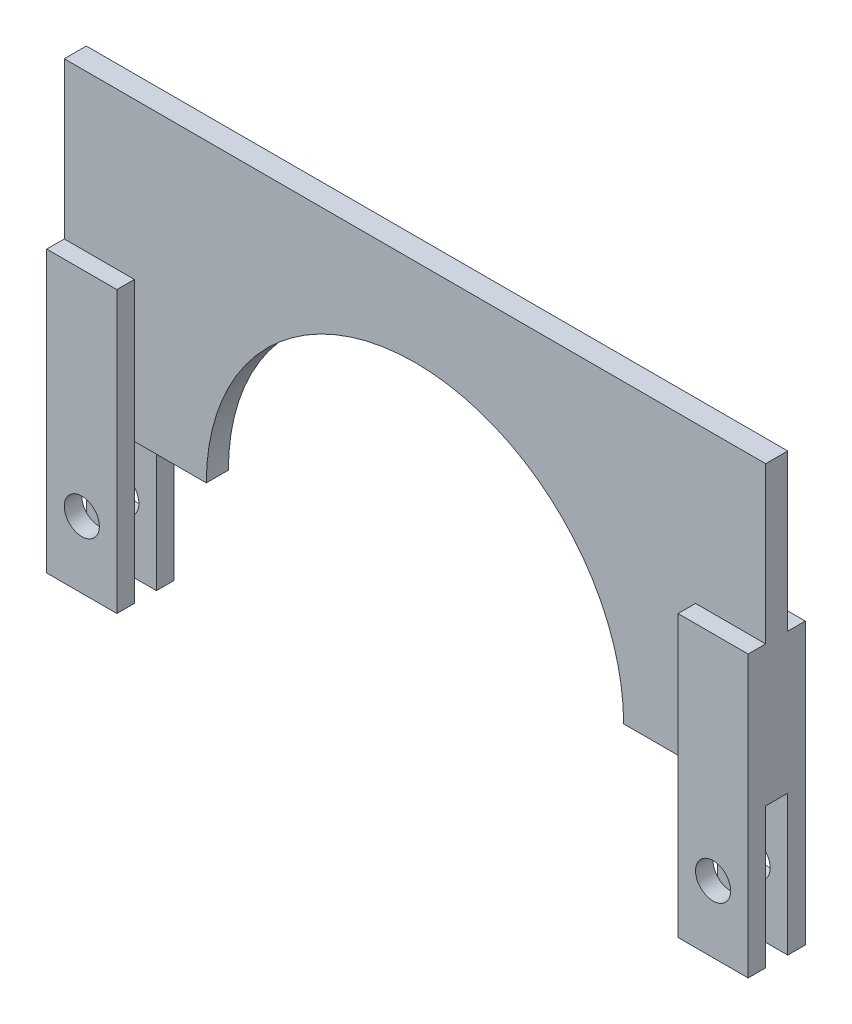
ISO-10303-21;
HEADER;
FILE_DESCRIPTION(('STEP AP214'),'2;1');
FILE_NAME('part.step','',(''),(''),'','','');
FILE_SCHEMA(('AUTOMOTIVE_DESIGN { 1 0 10303 214 1 1 1 1 }'));
ENDSEC;
DATA;
#1=APPLICATION_CONTEXT('core data for automotive mechanical design processes');
#2=APPLICATION_PROTOCOL_DEFINITION('international standard','automotive_design',2000,#1);
#3=PRODUCT_CONTEXT('',#1,'mechanical');
#4=PRODUCT('Part','Part','',(#3));
#5=PRODUCT_RELATED_PRODUCT_CATEGORY('part','',(#4));
#6=PRODUCT_DEFINITION_FORMATION('','',#4);
#7=PRODUCT_DEFINITION_CONTEXT('part definition',#1,'design');
#8=PRODUCT_DEFINITION('design','',#6,#7);
#9=PRODUCT_DEFINITION_SHAPE('','',#8);
#10=(LENGTH_UNIT() NAMED_UNIT(*) SI_UNIT(.MILLI.,.METRE.));
#11=(NAMED_UNIT(*) PLANE_ANGLE_UNIT() SI_UNIT($,.RADIAN.));
#12=(NAMED_UNIT(*) SI_UNIT($,.STERADIAN.) SOLID_ANGLE_UNIT());
#13=UNCERTAINTY_MEASURE_WITH_UNIT(LENGTH_MEASURE(1.E-05),#10,'distance_accuracy_value','');
#14=(GEOMETRIC_REPRESENTATION_CONTEXT(3) GLOBAL_UNCERTAINTY_ASSIGNED_CONTEXT((#13)) GLOBAL_UNIT_ASSIGNED_CONTEXT((#10,
#11,#12)) REPRESENTATION_CONTEXT('',''));
#15=CARTESIAN_POINT('',(0.,0.,0.));
#16=DIRECTION('',(0.,0.,1.));
#17=DIRECTION('',(1.,0.,0.));
#18=AXIS2_PLACEMENT_3D('',#15,#16,#17);
#19=CARTESIAN_POINT('',(0.,0.,0.798558565));
#20=DIRECTION('',(0.,0.,1.));
#21=DIRECTION('',(1.,0.,0.));
#22=AXIS2_PLACEMENT_3D('',#19,#20,#21);
#23=PLANE('',#22);
#24=DIRECTION('',(0.,-1.,0.));
#25=VECTOR('',#24,1.);
#26=CARTESIAN_POINT('',(-25.4,0.,0.798558565));
#27=LINE('',#26,#25);
#28=CARTESIAN_POINT('',(-25.4,21.463,0.798558565));
#29=VERTEX_POINT('',#28);
#30=CARTESIAN_POINT('',(-25.4,10.16,0.798558565));
#31=VERTEX_POINT('',#30);
#32=EDGE_CURVE('E65',#29,#31,#27,.T.);
#33=ORIENTED_EDGE('',*,*,#32,.T.);
#34=DIRECTION('',(-1.,0.,0.));
#35=VECTOR('',#34,1.);
#36=CARTESIAN_POINT('',(0.,10.16,0.798558565));
#37=LINE('',#36,#35);
#38=CARTESIAN_POINT('',(-20.32,10.16,0.798558565));
#39=VERTEX_POINT('',#38);
#40=EDGE_CURVE('E60',#39,#31,#37,.T.);
#41=ORIENTED_EDGE('',*,*,#40,.F.);
#42=DIRECTION('',(0.,1.,0.));
#43=VECTOR('',#42,1.);
#44=CARTESIAN_POINT('',(-20.32,0.,0.798558565));
#45=LINE('',#44,#43);
#46=CARTESIAN_POINT('',(-20.32,0.,0.798558565));
#47=VERTEX_POINT('',#46);
#48=EDGE_CURVE('E250',#47,#39,#45,.T.);
#49=ORIENTED_EDGE('',*,*,#48,.F.);
#50=DIRECTION('',(1.,0.,0.));
#51=VECTOR('',#50,1.);
#52=CARTESIAN_POINT('',(-25.4,0.,0.798558565));
#53=LINE('',#52,#51);
#54=CARTESIAN_POINT('',(-15.113,0.,0.798558565));
#55=VERTEX_POINT('',#54);
#56=EDGE_CURVE('E408',#47,#55,#53,.T.);
#57=ORIENTED_EDGE('',*,*,#56,.T.);
#58=CARTESIAN_POINT('',(0.,0.,0.798558565));
#59=DIRECTION('',(0.,0.,-1.));
#60=DIRECTION('',(1.,0.,0.));
#61=AXIS2_PLACEMENT_3D('',#58,#59,#60);
#62=CIRCLE('',#61,15.113);
#63=CARTESIAN_POINT('',(15.113,0.,0.798558565));
#64=VERTEX_POINT('',#63);
#65=EDGE_CURVE('E390',#55,#64,#62,.T.);
#66=ORIENTED_EDGE('',*,*,#65,.T.);
#67=DIRECTION('',(1.,0.,0.));
#68=VECTOR('',#67,1.);
#69=CARTESIAN_POINT('',(15.113,0.,0.798558565));
#70=LINE('',#69,#68);
#71=CARTESIAN_POINT('',(20.32,0.,0.798558565));
#72=VERTEX_POINT('',#71);
#73=EDGE_CURVE('E396',#64,#72,#70,.T.);
#74=ORIENTED_EDGE('',*,*,#73,.T.);
#75=DIRECTION('',(0.,1.,0.));
#76=VECTOR('',#75,1.);
#77=CARTESIAN_POINT('',(20.32,0.,0.798558565));
#78=LINE('',#77,#76);
#79=CARTESIAN_POINT('',(20.32,10.16,0.798558565));
#80=VERTEX_POINT('',#79);
#81=EDGE_CURVE('E51',#72,#80,#78,.T.);
#82=ORIENTED_EDGE('',*,*,#81,.T.);
#83=DIRECTION('',(1.,0.,0.));
#84=VECTOR('',#83,1.);
#85=CARTESIAN_POINT('',(0.,10.16,0.798558565));
#86=LINE('',#85,#84);
#87=CARTESIAN_POINT('',(25.4,10.16,0.798558565));
#88=VERTEX_POINT('',#87);
#89=EDGE_CURVE('E345',#80,#88,#86,.T.);
#90=ORIENTED_EDGE('',*,*,#89,.T.);
#91=DIRECTION('',(0.,1.,0.));
#92=VECTOR('',#91,1.);
#93=CARTESIAN_POINT('',(25.4,21.463,0.798558565));
#94=LINE('',#93,#92);
#95=CARTESIAN_POINT('',(25.4,21.463,0.798558565));
#96=VERTEX_POINT('',#95);
#97=EDGE_CURVE('E400',#88,#96,#94,.T.);
#98=ORIENTED_EDGE('',*,*,#97,.T.);
#99=DIRECTION('',(-1.,0.,0.));
#100=VECTOR('',#99,1.);
#101=CARTESIAN_POINT('',(-25.4,21.463,0.798558565));
#102=LINE('',#101,#100);
#103=EDGE_CURVE('E403',#96,#29,#102,.T.);
#104=ORIENTED_EDGE('',*,*,#103,.T.);
#105=EDGE_LOOP('',(#33,#41,#49,#57,#66,#74,#82,#90,#98,#104));
#106=FACE_BOUND('',#105,.T.);
#107=ADVANCED_FACE('F41',(#106),#23,.T.);
#108=CARTESIAN_POINT('',(0.,0.,-0.798558565));
#109=DIRECTION('',(0.,0.,1.));
#110=DIRECTION('',(1.,0.,0.));
#111=AXIS2_PLACEMENT_3D('',#108,#109,#110);
#112=PLANE('',#111);
#113=DIRECTION('',(0.,1.,0.));
#114=VECTOR('',#113,1.);
#115=CARTESIAN_POINT('',(-20.32,0.,-0.798558565));
#116=LINE('',#115,#114);
#117=CARTESIAN_POINT('',(-20.32,0.,-0.798558565));
#118=VERTEX_POINT('',#117);
#119=CARTESIAN_POINT('',(-20.32,10.16,-0.798558565));
#120=VERTEX_POINT('',#119);
#121=EDGE_CURVE('E282',#118,#120,#116,.T.);
#122=ORIENTED_EDGE('',*,*,#121,.T.);
#123=DIRECTION('',(-1.,0.,0.));
#124=VECTOR('',#123,1.);
#125=CARTESIAN_POINT('',(0.,10.16,-0.798558565));
#126=LINE('',#125,#124);
#127=CARTESIAN_POINT('',(-25.4,10.16,-0.798558565));
#128=VERTEX_POINT('',#127);
#129=EDGE_CURVE('E223',#120,#128,#126,.T.);
#130=ORIENTED_EDGE('',*,*,#129,.T.);
#131=DIRECTION('',(0.,-1.,0.));
#132=VECTOR('',#131,1.);
#133=CARTESIAN_POINT('',(-25.4,0.,-0.798558565));
#134=LINE('',#133,#132);
#135=CARTESIAN_POINT('',(-25.4,21.463,-0.798558565));
#136=VERTEX_POINT('',#135);
#137=EDGE_CURVE('E428',#136,#128,#134,.T.);
#138=ORIENTED_EDGE('',*,*,#137,.F.);
#139=DIRECTION('',(-1.,0.,0.));
#140=VECTOR('',#139,1.);
#141=CARTESIAN_POINT('',(-25.4,21.463,-0.798558565));
#142=LINE('',#141,#140);
#143=CARTESIAN_POINT('',(25.4,21.463,-0.798558565));
#144=VERTEX_POINT('',#143);
#145=EDGE_CURVE('E425',#144,#136,#142,.T.);
#146=ORIENTED_EDGE('',*,*,#145,.F.);
#147=DIRECTION('',(0.,1.,0.));
#148=VECTOR('',#147,1.);
#149=CARTESIAN_POINT('',(25.4,21.463,-0.798558565));
#150=LINE('',#149,#148);
#151=CARTESIAN_POINT('',(25.4,10.16,-0.798558565));
#152=VERTEX_POINT('',#151);
#153=EDGE_CURVE('E422',#152,#144,#150,.T.);
#154=ORIENTED_EDGE('',*,*,#153,.F.);
#155=DIRECTION('',(1.,0.,0.));
#156=VECTOR('',#155,1.);
#157=CARTESIAN_POINT('',(0.,10.16,-0.798558565));
#158=LINE('',#157,#156);
#159=CARTESIAN_POINT('',(20.32,10.16,-0.798558565));
#160=VERTEX_POINT('',#159);
#161=EDGE_CURVE('E304',#160,#152,#158,.T.);
#162=ORIENTED_EDGE('',*,*,#161,.F.);
#163=DIRECTION('',(0.,1.,0.));
#164=VECTOR('',#163,1.);
#165=CARTESIAN_POINT('',(20.32,0.,-0.798558565));
#166=LINE('',#165,#164);
#167=CARTESIAN_POINT('',(20.32,0.,-0.798558565));
#168=VERTEX_POINT('',#167);
#169=EDGE_CURVE('E11',#168,#160,#166,.T.);
#170=ORIENTED_EDGE('',*,*,#169,.F.);
#171=DIRECTION('',(1.,0.,0.));
#172=VECTOR('',#171,1.);
#173=CARTESIAN_POINT('',(15.113,0.,-0.798558565));
#174=LINE('',#173,#172);
#175=CARTESIAN_POINT('',(15.113,0.,-0.798558565));
#176=VERTEX_POINT('',#175);
#177=EDGE_CURVE('E418',#176,#168,#174,.T.);
#178=ORIENTED_EDGE('',*,*,#177,.F.);
#179=CARTESIAN_POINT('',(0.,0.,-0.798558565));
#180=DIRECTION('',(0.,0.,-1.));
#181=DIRECTION('',(1.,0.,0.));
#182=AXIS2_PLACEMENT_3D('',#179,#180,#181);
#183=CIRCLE('',#182,15.113);
#184=CARTESIAN_POINT('',(-15.113,0.,-0.798558565));
#185=VERTEX_POINT('',#184);
#186=EDGE_CURVE('E389',#185,#176,#183,.T.);
#187=ORIENTED_EDGE('',*,*,#186,.F.);
#188=DIRECTION('',(1.,0.,0.));
#189=VECTOR('',#188,1.);
#190=CARTESIAN_POINT('',(-25.4,0.,-0.798558565));
#191=LINE('',#190,#189);
#192=EDGE_CURVE('E431',#118,#185,#191,.T.);
#193=ORIENTED_EDGE('',*,*,#192,.F.);
#194=EDGE_LOOP('',(#122,#130,#138,#146,#154,#162,#170,#178,#187,#193));
#195=FACE_BOUND('',#194,.T.);
#196=ADVANCED_FACE('F479',(#195),#112,.F.);
#197=CARTESIAN_POINT('',(0.,0.,0.798558565));
#198=DIRECTION('',(0.,0.,-1.));
#199=DIRECTION('',(-1.,0.,0.));
#200=AXIS2_PLACEMENT_3D('',#197,#198,#199);
#201=CYLINDRICAL_SURFACE('',#200,15.113);
#202=ORIENTED_EDGE('',*,*,#186,.T.);
#203=DIRECTION('',(0.,0.,-1.));
#204=VECTOR('',#203,1.);
#205=CARTESIAN_POINT('',(15.113,0.,0.798558565));
#206=LINE('',#205,#204);
#207=EDGE_CURVE('E453',#64,#176,#206,.T.);
#208=ORIENTED_EDGE('',*,*,#207,.F.);
#209=ORIENTED_EDGE('',*,*,#65,.F.);
#210=DIRECTION('',(0.,0.,-1.));
#211=VECTOR('',#210,1.);
#212=CARTESIAN_POINT('',(-15.113,0.,0.798558565));
#213=LINE('',#212,#211);
#214=EDGE_CURVE('E413',#55,#185,#213,.T.);
#215=ORIENTED_EDGE('',*,*,#214,.T.);
#216=EDGE_LOOP('',(#202,#208,#209,#215));
#217=FACE_BOUND('',#216,.T.);
#218=ADVANCED_FACE('F43',(#217),#201,.F.);
#219=CARTESIAN_POINT('',(15.113,0.,0.798558565));
#220=DIRECTION('',(0.,1.,0.));
#221=DIRECTION('',(0.,0.,1.));
#222=AXIS2_PLACEMENT_3D('',#219,#220,#221);
#223=PLANE('',#222);
#224=ORIENTED_EDGE('',*,*,#177,.T.);
#225=CARTESIAN_POINT('',(25.4,0.,-0.798558565));
#226=VERTEX_POINT('',#225);
#227=EDGE_CURVE('E417',#168,#226,#174,.T.);
#228=ORIENTED_EDGE('',*,*,#227,.T.);
#229=DIRECTION('',(0.,0.,-1.));
#230=VECTOR('',#229,1.);
#231=CARTESIAN_POINT('',(25.4,0.,0.798558565));
#232=LINE('',#231,#230);
#233=CARTESIAN_POINT('',(25.4,0.,0.798558565));
#234=VERTEX_POINT('',#233);
#235=EDGE_CURVE('E450',#234,#226,#232,.T.);
#236=ORIENTED_EDGE('',*,*,#235,.F.);
#237=EDGE_CURVE('E394',#72,#234,#70,.T.);
#238=ORIENTED_EDGE('',*,*,#237,.F.);
#239=ORIENTED_EDGE('',*,*,#73,.F.);
#240=ORIENTED_EDGE('',*,*,#207,.T.);
#241=EDGE_LOOP('',(#224,#228,#236,#238,#239,#240));
#242=FACE_BOUND('',#241,.T.);
#243=ADVANCED_FACE('F470',(#242),#223,.F.);
#244=CARTESIAN_POINT('',(25.4,21.463,0.798558565));
#245=DIRECTION('',(-1.,0.,0.));
#246=DIRECTION('',(0.,0.,1.));
#247=AXIS2_PLACEMENT_3D('',#244,#245,#246);
#248=PLANE('',#247);
#249=ORIENTED_EDGE('',*,*,#235,.T.);
#250=DIRECTION('',(0.,1.,0.));
#251=VECTOR('',#250,1.);
#252=CARTESIAN_POINT('',(25.4,0.,-0.798558565));
#253=LINE('',#252,#251);
#254=CARTESIAN_POINT('',(25.4,-10.16,-0.798558565));
#255=VERTEX_POINT('',#254);
#256=EDGE_CURVE('E322',#255,#226,#253,.T.);
#257=ORIENTED_EDGE('',*,*,#256,.F.);
#258=DIRECTION('',(0.,0.,1.));
#259=VECTOR('',#258,1.);
#260=CARTESIAN_POINT('',(25.4,-10.16,-2.068558565));
#261=LINE('',#260,#259);
#262=CARTESIAN_POINT('',(25.4,-10.16,-2.068558565));
#263=VERTEX_POINT('',#262);
#264=EDGE_CURVE('E338',#263,#255,#261,.T.);
#265=ORIENTED_EDGE('',*,*,#264,.F.);
#266=DIRECTION('',(0.,1.,0.));
#267=VECTOR('',#266,1.);
#268=CARTESIAN_POINT('',(25.4,0.,-2.068558565));
#269=LINE('',#268,#267);
#270=CARTESIAN_POINT('',(25.4,10.16,-2.068558565));
#271=VERTEX_POINT('',#270);
#272=EDGE_CURVE('E308',#263,#271,#269,.T.);
#273=ORIENTED_EDGE('',*,*,#272,.T.);
#274=DIRECTION('',(0.,0.,1.));
#275=VECTOR('',#274,1.);
#276=CARTESIAN_POINT('',(25.4,10.16,-2.068558565));
#277=LINE('',#276,#275);
#278=EDGE_CURVE('E341',#271,#152,#277,.T.);
#279=ORIENTED_EDGE('',*,*,#278,.T.);
#280=ORIENTED_EDGE('',*,*,#153,.T.);
#281=DIRECTION('',(0.,0.,-1.));
#282=VECTOR('',#281,1.);
#283=CARTESIAN_POINT('',(25.4,21.463,0.798558565));
#284=LINE('',#283,#282);
#285=EDGE_CURVE('E446',#96,#144,#284,.T.);
#286=ORIENTED_EDGE('',*,*,#285,.F.);
#287=ORIENTED_EDGE('',*,*,#97,.F.);
#288=DIRECTION('',(0.,0.,-1.));
#289=VECTOR('',#288,1.);
#290=CARTESIAN_POINT('',(25.4,10.16,2.068558565));
#291=LINE('',#290,#289);
#292=CARTESIAN_POINT('',(25.4,10.16,2.068558565));
#293=VERTEX_POINT('',#292);
#294=EDGE_CURVE('E362',#293,#88,#291,.T.);
#295=ORIENTED_EDGE('',*,*,#294,.F.);
#296=DIRECTION('',(0.,1.,0.));
#297=VECTOR('',#296,1.);
#298=CARTESIAN_POINT('',(25.4,0.,2.068558565));
#299=LINE('',#298,#297);
#300=CARTESIAN_POINT('',(25.4,-10.16,2.068558565));
#301=VERTEX_POINT('',#300);
#302=EDGE_CURVE('E359',#301,#293,#299,.T.);
#303=ORIENTED_EDGE('',*,*,#302,.F.);
#304=DIRECTION('',(0.,0.,-1.));
#305=VECTOR('',#304,1.);
#306=CARTESIAN_POINT('',(25.4,-10.16,2.068558565));
#307=LINE('',#306,#305);
#308=CARTESIAN_POINT('',(25.4,-10.16,0.798558565));
#309=VERTEX_POINT('',#308);
#310=EDGE_CURVE('E379',#301,#309,#307,.T.);
#311=ORIENTED_EDGE('',*,*,#310,.T.);
#312=DIRECTION('',(0.,1.,0.));
#313=VECTOR('',#312,1.);
#314=CARTESIAN_POINT('',(25.4,0.,0.798558565));
#315=LINE('',#314,#313);
#316=EDGE_CURVE('E351',#309,#234,#315,.T.);
#317=ORIENTED_EDGE('',*,*,#316,.T.);
#318=EDGE_LOOP('',(#249,#257,#265,#273,#279,#280,#286,#287,#295,#303,#311,#317));
#319=FACE_BOUND('',#318,.T.);
#320=ADVANCED_FACE('F500',(#319),#248,.F.);
#321=CARTESIAN_POINT('',(-25.4,21.463,0.798558565));
#322=DIRECTION('',(0.,-1.,0.));
#323=DIRECTION('',(0.,0.,-1.));
#324=AXIS2_PLACEMENT_3D('',#321,#322,#323);
#325=PLANE('',#324);
#326=ORIENTED_EDGE('',*,*,#145,.T.);
#327=DIRECTION('',(0.,0.,-1.));
#328=VECTOR('',#327,1.);
#329=CARTESIAN_POINT('',(-25.4,21.463,0.798558565));
#330=LINE('',#329,#328);
#331=EDGE_CURVE('E442',#29,#136,#330,.T.);
#332=ORIENTED_EDGE('',*,*,#331,.F.);
#333=ORIENTED_EDGE('',*,*,#103,.F.);
#334=ORIENTED_EDGE('',*,*,#285,.T.);
#335=EDGE_LOOP('',(#326,#332,#333,#334));
#336=FACE_BOUND('',#335,.T.);
#337=ADVANCED_FACE('F496',(#336),#325,.F.);
#338=CARTESIAN_POINT('',(-25.4,0.,0.798558565));
#339=DIRECTION('',(1.,0.,0.));
#340=DIRECTION('',(0.,0.,-1.));
#341=AXIS2_PLACEMENT_3D('',#338,#339,#340);
#342=PLANE('',#341);
#343=ORIENTED_EDGE('',*,*,#137,.T.);
#344=DIRECTION('',(0.,0.,1.));
#345=VECTOR('',#344,1.);
#346=CARTESIAN_POINT('',(-25.4,10.16,-2.068558565));
#347=LINE('',#346,#345);
#348=CARTESIAN_POINT('',(-25.4,10.16,-2.068558565));
#349=VERTEX_POINT('',#348);
#350=EDGE_CURVE('E278',#349,#128,#347,.T.);
#351=ORIENTED_EDGE('',*,*,#350,.F.);
#352=DIRECTION('',(0.,1.,0.));
#353=VECTOR('',#352,1.);
#354=CARTESIAN_POINT('',(-25.4,0.,-2.068558565));
#355=LINE('',#354,#353);
#356=CARTESIAN_POINT('',(-25.4,-10.16,-2.068558565));
#357=VERTEX_POINT('',#356);
#358=EDGE_CURVE('E275',#357,#349,#355,.T.);
#359=ORIENTED_EDGE('',*,*,#358,.F.);
#360=DIRECTION('',(0.,0.,1.));
#361=VECTOR('',#360,1.);
#362=CARTESIAN_POINT('',(-25.4,-10.16,-2.068558565));
#363=LINE('',#362,#361);
#364=CARTESIAN_POINT('',(-25.4,-10.16,-0.798558565));
#365=VERTEX_POINT('',#364);
#366=EDGE_CURVE('E295',#357,#365,#363,.T.);
#367=ORIENTED_EDGE('',*,*,#366,.T.);
#368=DIRECTION('',(0.,1.,0.));
#369=VECTOR('',#368,1.);
#370=CARTESIAN_POINT('',(-25.4,0.,-0.798558565));
#371=LINE('',#370,#369);
#372=CARTESIAN_POINT('',(-25.4,0.,-0.798558565));
#373=VERTEX_POINT('',#372);
#374=EDGE_CURVE('E267',#365,#373,#371,.T.);
#375=ORIENTED_EDGE('',*,*,#374,.T.);
#376=DIRECTION('',(0.,0.,-1.));
#377=VECTOR('',#376,1.);
#378=CARTESIAN_POINT('',(-25.4,0.,0.798558565));
#379=LINE('',#378,#377);
#380=CARTESIAN_POINT('',(-25.4,0.,0.798558565));
#381=VERTEX_POINT('',#380);
#382=EDGE_CURVE('E438',#381,#373,#379,.T.);
#383=ORIENTED_EDGE('',*,*,#382,.F.);
#384=DIRECTION('',(0.,1.,0.));
#385=VECTOR('',#384,1.);
#386=CARTESIAN_POINT('',(-25.4,0.,0.798558565));
#387=LINE('',#386,#385);
#388=CARTESIAN_POINT('',(-25.4,-10.16,0.798558565));
#389=VERTEX_POINT('',#388);
#390=EDGE_CURVE('E242',#389,#381,#387,.T.);
#391=ORIENTED_EDGE('',*,*,#390,.F.);
#392=DIRECTION('',(0.,0.,-1.));
#393=VECTOR('',#392,1.);
#394=CARTESIAN_POINT('',(-25.4,-10.16,2.068558565));
#395=LINE('',#394,#393);
#396=CARTESIAN_POINT('',(-25.4,-10.16,2.068558565));
#397=VERTEX_POINT('',#396);
#398=EDGE_CURVE('E224',#397,#389,#395,.T.);
#399=ORIENTED_EDGE('',*,*,#398,.F.);
#400=DIRECTION('',(0.,1.,0.));
#401=VECTOR('',#400,1.);
#402=CARTESIAN_POINT('',(-25.4,0.,2.068558565));
#403=LINE('',#402,#401);
#404=CARTESIAN_POINT('',(-25.4,10.16,2.068558565));
#405=VERTEX_POINT('',#404);
#406=EDGE_CURVE('E210',#397,#405,#403,.T.);
#407=ORIENTED_EDGE('',*,*,#406,.T.);
#408=DIRECTION('',(0.,0.,-1.));
#409=VECTOR('',#408,1.);
#410=CARTESIAN_POINT('',(-25.4,10.16,2.068558565));
#411=LINE('',#410,#409);
#412=EDGE_CURVE('E219',#405,#31,#411,.T.);
#413=ORIENTED_EDGE('',*,*,#412,.T.);
#414=ORIENTED_EDGE('',*,*,#32,.F.);
#415=ORIENTED_EDGE('',*,*,#331,.T.);
#416=EDGE_LOOP('',(#343,#351,#359,#367,#375,#383,#391,#399,#407,#413,#414,#415));
#417=FACE_BOUND('',#416,.T.);
#418=ADVANCED_FACE('F227',(#417),#342,.F.);
#419=CARTESIAN_POINT('',(-25.4,0.,0.798558565));
#420=DIRECTION('',(0.,1.,0.));
#421=DIRECTION('',(0.,0.,1.));
#422=AXIS2_PLACEMENT_3D('',#419,#420,#421);
#423=PLANE('',#422);
#424=EDGE_CURVE('E395',#373,#118,#191,.T.);
#425=ORIENTED_EDGE('',*,*,#424,.T.);
#426=ORIENTED_EDGE('',*,*,#192,.T.);
#427=ORIENTED_EDGE('',*,*,#214,.F.);
#428=ORIENTED_EDGE('',*,*,#56,.F.);
#429=EDGE_CURVE('E409',#381,#47,#53,.T.);
#430=ORIENTED_EDGE('',*,*,#429,.F.);
#431=ORIENTED_EDGE('',*,*,#382,.T.);
#432=EDGE_LOOP('',(#425,#426,#427,#428,#430,#431));
#433=FACE_BOUND('',#432,.T.);
#434=ADVANCED_FACE('F535',(#433),#423,.F.);
#435=CARTESIAN_POINT('',(0.,0.,0.798558565));
#436=DIRECTION('',(0.,0.,1.));
#437=DIRECTION('',(1.,0.,0.));
#438=AXIS2_PLACEMENT_3D('',#435,#436,#437);
#439=PLANE('',#438);
#440=CARTESIAN_POINT('',(22.86,-5.334,0.798558565));
#441=DIRECTION('',(0.,0.,1.));
#442=DIRECTION('',(1.,0.,0.));
#443=AXIS2_PLACEMENT_3D('',#440,#441,#442);
#444=CIRCLE('',#443,1.27);
#445=CARTESIAN_POINT('',(24.13,-5.334,0.798558565));
#446=VERTEX_POINT('',#445);
#447=EDGE_CURVE('E243',#446,#446,#444,.T.);
#448=ORIENTED_EDGE('',*,*,#447,.T.);
#449=EDGE_LOOP('',(#448));
#450=FACE_BOUND('',#449,.T.);
#451=CARTESIAN_POINT('',(20.32,-10.16,0.798558565));
#452=VERTEX_POINT('',#451);
#453=EDGE_CURVE('E366',#452,#72,#78,.T.);
#454=ORIENTED_EDGE('',*,*,#453,.T.);
#455=ORIENTED_EDGE('',*,*,#237,.T.);
#456=ORIENTED_EDGE('',*,*,#316,.F.);
#457=DIRECTION('',(-1.,0.,0.));
#458=VECTOR('',#457,1.);
#459=CARTESIAN_POINT('',(0.,-10.16,0.798558565));
#460=LINE('',#459,#458);
#461=EDGE_CURVE('E370',#309,#452,#460,.T.);
#462=ORIENTED_EDGE('',*,*,#461,.T.);
#463=EDGE_LOOP('',(#454,#455,#456,#462));
#464=FACE_BOUND('',#463,.T.);
#465=ADVANCED_FACE('F466',(#450,#464),#439,.F.);
#466=CARTESIAN_POINT('',(0.,10.16,2.068558565));
#467=DIRECTION('',(0.,1.,0.));
#468=DIRECTION('',(0.,0.,1.));
#469=AXIS2_PLACEMENT_3D('',#466,#467,#468);
#470=PLANE('',#469);
#471=ORIENTED_EDGE('',*,*,#89,.F.);
#472=DIRECTION('',(0.,0.,-1.));
#473=VECTOR('',#472,1.);
#474=CARTESIAN_POINT('',(20.32,10.16,2.068558565));
#475=LINE('',#474,#473);
#476=CARTESIAN_POINT('',(20.32,10.16,2.068558565));
#477=VERTEX_POINT('',#476);
#478=EDGE_CURVE('E385',#477,#80,#475,.T.);
#479=ORIENTED_EDGE('',*,*,#478,.F.);
#480=DIRECTION('',(1.,0.,0.));
#481=VECTOR('',#480,1.);
#482=CARTESIAN_POINT('',(0.,10.16,2.068558565));
#483=LINE('',#482,#481);
#484=EDGE_CURVE('E346',#477,#293,#483,.T.);
#485=ORIENTED_EDGE('',*,*,#484,.T.);
#486=ORIENTED_EDGE('',*,*,#294,.T.);
#487=EDGE_LOOP('',(#471,#479,#485,#486));
#488=FACE_BOUND('',#487,.T.);
#489=ADVANCED_FACE('F527',(#488),#470,.T.);
#490=CARTESIAN_POINT('',(20.32,0.,2.068558565));
#491=DIRECTION('',(-1.,0.,0.));
#492=DIRECTION('',(0.,-1.,0.));
#493=AXIS2_PLACEMENT_3D('',#490,#491,#492);
#494=PLANE('',#493);
#495=ORIENTED_EDGE('',*,*,#453,.F.);
#496=DIRECTION('',(0.,0.,-1.));
#497=VECTOR('',#496,1.);
#498=CARTESIAN_POINT('',(20.32,-10.16,2.068558565));
#499=LINE('',#498,#497);
#500=CARTESIAN_POINT('',(20.32,-10.16,2.068558565));
#501=VERTEX_POINT('',#500);
#502=EDGE_CURVE('E382',#501,#452,#499,.T.);
#503=ORIENTED_EDGE('',*,*,#502,.F.);
#504=DIRECTION('',(0.,1.,0.));
#505=VECTOR('',#504,1.);
#506=CARTESIAN_POINT('',(20.32,0.,2.068558565));
#507=LINE('',#506,#505);
#508=EDGE_CURVE('E350',#501,#477,#507,.T.);
#509=ORIENTED_EDGE('',*,*,#508,.T.);
#510=ORIENTED_EDGE('',*,*,#478,.T.);
#511=ORIENTED_EDGE('',*,*,#81,.F.);
#512=EDGE_LOOP('',(#495,#503,#509,#510,#511));
#513=FACE_BOUND('',#512,.T.);
#514=ADVANCED_FACE('F463',(#513),#494,.T.);
#515=CARTESIAN_POINT('',(0.,-10.16,2.068558565));
#516=DIRECTION('',(0.,-1.,0.));
#517=DIRECTION('',(0.,0.,-1.));
#518=AXIS2_PLACEMENT_3D('',#515,#516,#517);
#519=PLANE('',#518);
#520=ORIENTED_EDGE('',*,*,#461,.F.);
#521=ORIENTED_EDGE('',*,*,#310,.F.);
#522=DIRECTION('',(-1.,0.,0.));
#523=VECTOR('',#522,1.);
#524=CARTESIAN_POINT('',(0.,-10.16,2.068558565));
#525=LINE('',#524,#523);
#526=EDGE_CURVE('E355',#301,#501,#525,.T.);
#527=ORIENTED_EDGE('',*,*,#526,.T.);
#528=ORIENTED_EDGE('',*,*,#502,.T.);
#529=EDGE_LOOP('',(#520,#521,#527,#528));
#530=FACE_BOUND('',#529,.T.);
#531=ADVANCED_FACE('F520',(#530),#519,.T.);
#532=CARTESIAN_POINT('',(0.,0.,2.068558565));
#533=DIRECTION('',(0.,0.,1.));
#534=DIRECTION('',(1.,0.,0.));
#535=AXIS2_PLACEMENT_3D('',#532,#533,#534);
#536=PLANE('',#535);
#537=CARTESIAN_POINT('',(22.86,-5.334,2.068558565));
#538=DIRECTION('',(0.,0.,-1.));
#539=DIRECTION('',(-1.,0.,0.));
#540=AXIS2_PLACEMENT_3D('',#537,#538,#539);
#541=CIRCLE('',#540,1.27);
#542=CARTESIAN_POINT('',(21.59,-5.334,2.068558565));
#543=VERTEX_POINT('',#542);
#544=EDGE_CURVE('E889',#543,#543,#541,.T.);
#545=ORIENTED_EDGE('',*,*,#544,.T.);
#546=EDGE_LOOP('',(#545));
#547=FACE_BOUND('',#546,.T.);
#548=ORIENTED_EDGE('',*,*,#484,.F.);
#549=ORIENTED_EDGE('',*,*,#508,.F.);
#550=ORIENTED_EDGE('',*,*,#526,.F.);
#551=ORIENTED_EDGE('',*,*,#302,.T.);
#552=EDGE_LOOP('',(#548,#549,#550,#551));
#553=FACE_BOUND('',#552,.T.);
#554=ADVANCED_FACE('F525',(#547,#553),#536,.T.);
#555=CARTESIAN_POINT('',(0.,10.16,-2.068558565));
#556=DIRECTION('',(0.,-1.,0.));
#557=DIRECTION('',(0.,0.,-1.));
#558=AXIS2_PLACEMENT_3D('',#555,#556,#557);
#559=PLANE('',#558);
#560=ORIENTED_EDGE('',*,*,#161,.T.);
#561=ORIENTED_EDGE('',*,*,#278,.F.);
#562=DIRECTION('',(1.,0.,0.));
#563=VECTOR('',#562,1.);
#564=CARTESIAN_POINT('',(0.,10.16,-2.068558565));
#565=LINE('',#564,#563);
#566=CARTESIAN_POINT('',(20.32,10.16,-2.068558565));
#567=VERTEX_POINT('',#566);
#568=EDGE_CURVE('E305',#567,#271,#565,.T.);
#569=ORIENTED_EDGE('',*,*,#568,.F.);
#570=DIRECTION('',(0.,0.,1.));
#571=VECTOR('',#570,1.);
#572=CARTESIAN_POINT('',(20.32,10.16,-2.068558565));
#573=LINE('',#572,#571);
#574=EDGE_CURVE('E318',#567,#160,#573,.T.);
#575=ORIENTED_EDGE('',*,*,#574,.T.);
#576=EDGE_LOOP('',(#560,#561,#569,#575));
#577=FACE_BOUND('',#576,.T.);
#578=ADVANCED_FACE('F506',(#577),#559,.F.);
#579=CARTESIAN_POINT('',(0.,-10.16,-2.068558565));
#580=DIRECTION('',(0.,1.,0.));
#581=DIRECTION('',(0.,0.,1.));
#582=AXIS2_PLACEMENT_3D('',#579,#580,#581);
#583=PLANE('',#582);
#584=DIRECTION('',(-1.,0.,0.));
#585=VECTOR('',#584,1.);
#586=CARTESIAN_POINT('',(0.,-10.16,-0.798558565));
#587=LINE('',#586,#585);
#588=CARTESIAN_POINT('',(20.32,-10.16,-0.798558565));
#589=VERTEX_POINT('',#588);
#590=EDGE_CURVE('E326',#255,#589,#587,.T.);
#591=ORIENTED_EDGE('',*,*,#590,.T.);
#592=DIRECTION('',(0.,0.,1.));
#593=VECTOR('',#592,1.);
#594=CARTESIAN_POINT('',(20.32,-10.16,-2.068558565));
#595=LINE('',#594,#593);
#596=CARTESIAN_POINT('',(20.32,-10.16,-2.068558565));
#597=VERTEX_POINT('',#596);
#598=EDGE_CURVE('E334',#597,#589,#595,.T.);
#599=ORIENTED_EDGE('',*,*,#598,.F.);
#600=DIRECTION('',(-1.,0.,0.));
#601=VECTOR('',#600,1.);
#602=CARTESIAN_POINT('',(0.,-10.16,-2.068558565));
#603=LINE('',#602,#601);
#604=EDGE_CURVE('E312',#263,#597,#603,.T.);
#605=ORIENTED_EDGE('',*,*,#604,.F.);
#606=ORIENTED_EDGE('',*,*,#264,.T.);
#607=EDGE_LOOP('',(#591,#599,#605,#606));
#608=FACE_BOUND('',#607,.T.);
#609=ADVANCED_FACE('F602',(#608),#583,.F.);
#610=CARTESIAN_POINT('',(20.32,0.,-2.068558565));
#611=DIRECTION('',(1.,0.,0.));
#612=DIRECTION('',(0.,1.,0.));
#613=AXIS2_PLACEMENT_3D('',#610,#611,#612);
#614=PLANE('',#613);
#615=EDGE_CURVE('E53',#589,#168,#166,.T.);
#616=ORIENTED_EDGE('',*,*,#615,.T.);
#617=ORIENTED_EDGE('',*,*,#169,.T.);
#618=ORIENTED_EDGE('',*,*,#574,.F.);
#619=DIRECTION('',(0.,1.,0.));
#620=VECTOR('',#619,1.);
#621=CARTESIAN_POINT('',(20.32,0.,-2.068558565));
#622=LINE('',#621,#620);
#623=EDGE_CURVE('E315',#597,#567,#622,.T.);
#624=ORIENTED_EDGE('',*,*,#623,.F.);
#625=ORIENTED_EDGE('',*,*,#598,.T.);
#626=EDGE_LOOP('',(#616,#617,#618,#624,#625));
#627=FACE_BOUND('',#626,.T.);
#628=ADVANCED_FACE('F509',(#627),#614,.F.);
#629=CARTESIAN_POINT('',(0.,0.,-2.068558565));
#630=DIRECTION('',(0.,0.,-1.));
#631=DIRECTION('',(1.,0.,0.));
#632=AXIS2_PLACEMENT_3D('',#629,#630,#631);
#633=PLANE('',#632);
#634=CARTESIAN_POINT('',(22.86,-5.334,-2.068558565));
#635=DIRECTION('',(0.,0.,-1.));
#636=DIRECTION('',(-1.,0.,0.));
#637=AXIS2_PLACEMENT_3D('',#634,#635,#636);
#638=CIRCLE('',#637,1.27);
#639=CARTESIAN_POINT('',(21.59,-5.334,-2.068558565));
#640=VERTEX_POINT('',#639);
#641=EDGE_CURVE('E883',#640,#640,#638,.T.);
#642=ORIENTED_EDGE('',*,*,#641,.F.);
#643=EDGE_LOOP('',(#642));
#644=FACE_BOUND('',#643,.T.);
#645=ORIENTED_EDGE('',*,*,#568,.T.);
#646=ORIENTED_EDGE('',*,*,#272,.F.);
#647=ORIENTED_EDGE('',*,*,#604,.T.);
#648=ORIENTED_EDGE('',*,*,#623,.T.);
#649=EDGE_LOOP('',(#645,#646,#647,#648));
#650=FACE_BOUND('',#649,.T.);
#651=ADVANCED_FACE('F593',(#644,#650),#633,.T.);
#652=CARTESIAN_POINT('',(0.,0.,-0.798558565));
#653=DIRECTION('',(0.,0.,-1.));
#654=DIRECTION('',(1.,0.,0.));
#655=AXIS2_PLACEMENT_3D('',#652,#653,#654);
#656=PLANE('',#655);
#657=CARTESIAN_POINT('',(22.86,-5.334,-0.798558565));
#658=DIRECTION('',(0.,0.,-1.));
#659=DIRECTION('',(-1.,0.,0.));
#660=AXIS2_PLACEMENT_3D('',#657,#658,#659);
#661=CIRCLE('',#660,1.27);
#662=CARTESIAN_POINT('',(21.59,-5.334,-0.798558565));
#663=VERTEX_POINT('',#662);
#664=EDGE_CURVE('E45',#663,#663,#661,.T.);
#665=ORIENTED_EDGE('',*,*,#664,.T.);
#666=EDGE_LOOP('',(#665));
#667=FACE_BOUND('',#666,.T.);
#668=ORIENTED_EDGE('',*,*,#227,.F.);
#669=ORIENTED_EDGE('',*,*,#615,.F.);
#670=ORIENTED_EDGE('',*,*,#590,.F.);
#671=ORIENTED_EDGE('',*,*,#256,.T.);
#672=EDGE_LOOP('',(#668,#669,#670,#671));
#673=FACE_BOUND('',#672,.T.);
#674=ADVANCED_FACE('F516',(#667,#673),#656,.F.);
#675=CARTESIAN_POINT('',(0.,0.,-0.798558565));
#676=DIRECTION('',(0.,0.,-1.));
#677=DIRECTION('',(-1.,0.,0.));
#678=AXIS2_PLACEMENT_3D('',#675,#676,#677);
#679=PLANE('',#678);
#680=CARTESIAN_POINT('',(-22.86,-5.334,-0.798558565));
#681=DIRECTION('',(0.,0.,-1.));
#682=DIRECTION('',(-1.,0.,0.));
#683=AXIS2_PLACEMENT_3D('',#680,#681,#682);
#684=CIRCLE('',#683,1.27);
#685=CARTESIAN_POINT('',(-24.13,-5.334,-0.798558565));
#686=VERTEX_POINT('',#685);
#687=EDGE_CURVE('E881',#686,#686,#684,.F.);
#688=ORIENTED_EDGE('',*,*,#687,.F.);
#689=EDGE_LOOP('',(#688));
#690=FACE_BOUND('',#689,.T.);
#691=CARTESIAN_POINT('',(-20.32,-10.16,-0.798558565));
#692=VERTEX_POINT('',#691);
#693=EDGE_CURVE('E283',#692,#118,#116,.T.);
#694=ORIENTED_EDGE('',*,*,#693,.T.);
#695=ORIENTED_EDGE('',*,*,#424,.F.);
#696=ORIENTED_EDGE('',*,*,#374,.F.);
#697=DIRECTION('',(1.,0.,0.));
#698=VECTOR('',#697,1.);
#699=CARTESIAN_POINT('',(0.,-10.16,-0.798558565));
#700=LINE('',#699,#698);
#701=EDGE_CURVE('E286',#365,#692,#700,.T.);
#702=ORIENTED_EDGE('',*,*,#701,.T.);
#703=EDGE_LOOP('',(#694,#695,#696,#702));
#704=FACE_BOUND('',#703,.T.);
#705=ADVANCED_FACE('F565',(#690,#704),#679,.F.);
#706=CARTESIAN_POINT('',(0.,10.16,-2.068558565));
#707=DIRECTION('',(0.,1.,0.));
#708=DIRECTION('',(0.,0.,1.));
#709=AXIS2_PLACEMENT_3D('',#706,#707,#708);
#710=PLANE('',#709);
#711=ORIENTED_EDGE('',*,*,#129,.F.);
#712=DIRECTION('',(0.,0.,1.));
#713=VECTOR('',#712,1.);
#714=CARTESIAN_POINT('',(-20.32,10.16,-2.068558565));
#715=LINE('',#714,#713);
#716=CARTESIAN_POINT('',(-20.32,10.16,-2.068558565));
#717=VERTEX_POINT('',#716);
#718=EDGE_CURVE('E301',#717,#120,#715,.T.);
#719=ORIENTED_EDGE('',*,*,#718,.F.);
#720=DIRECTION('',(-1.,0.,0.));
#721=VECTOR('',#720,1.);
#722=CARTESIAN_POINT('',(0.,10.16,-2.068558565));
#723=LINE('',#722,#721);
#724=EDGE_CURVE('E262',#717,#349,#723,.T.);
#725=ORIENTED_EDGE('',*,*,#724,.T.);
#726=ORIENTED_EDGE('',*,*,#350,.T.);
#727=EDGE_LOOP('',(#711,#719,#725,#726));
#728=FACE_BOUND('',#727,.T.);
#729=ADVANCED_FACE('F489',(#728),#710,.T.);
#730=CARTESIAN_POINT('',(-20.32,0.,-2.068558565));
#731=DIRECTION('',(1.,0.,0.));
#732=DIRECTION('',(0.,1.,0.));
#733=AXIS2_PLACEMENT_3D('',#730,#731,#732);
#734=PLANE('',#733);
#735=ORIENTED_EDGE('',*,*,#693,.F.);
#736=DIRECTION('',(0.,0.,1.));
#737=VECTOR('',#736,1.);
#738=CARTESIAN_POINT('',(-20.32,-10.16,-2.068558565));
#739=LINE('',#738,#737);
#740=CARTESIAN_POINT('',(-20.32,-10.16,-2.068558565));
#741=VERTEX_POINT('',#740);
#742=EDGE_CURVE('E298',#741,#692,#739,.T.);
#743=ORIENTED_EDGE('',*,*,#742,.F.);
#744=DIRECTION('',(0.,1.,0.));
#745=VECTOR('',#744,1.);
#746=CARTESIAN_POINT('',(-20.32,0.,-2.068558565));
#747=LINE('',#746,#745);
#748=EDGE_CURVE('E266',#741,#717,#747,.T.);
#749=ORIENTED_EDGE('',*,*,#748,.T.);
#750=ORIENTED_EDGE('',*,*,#718,.T.);
#751=ORIENTED_EDGE('',*,*,#121,.F.);
#752=EDGE_LOOP('',(#735,#743,#749,#750,#751));
#753=FACE_BOUND('',#752,.T.);
#754=ADVANCED_FACE('F485',(#753),#734,.T.);
#755=CARTESIAN_POINT('',(0.,-10.16,-2.068558565));
#756=DIRECTION('',(0.,-1.,0.));
#757=DIRECTION('',(0.,0.,-1.));
#758=AXIS2_PLACEMENT_3D('',#755,#756,#757);
#759=PLANE('',#758);
#760=ORIENTED_EDGE('',*,*,#701,.F.);
#761=ORIENTED_EDGE('',*,*,#366,.F.);
#762=DIRECTION('',(1.,0.,0.));
#763=VECTOR('',#762,1.);
#764=CARTESIAN_POINT('',(0.,-10.16,-2.068558565));
#765=LINE('',#764,#763);
#766=EDGE_CURVE('E271',#357,#741,#765,.T.);
#767=ORIENTED_EDGE('',*,*,#766,.T.);
#768=ORIENTED_EDGE('',*,*,#742,.T.);
#769=EDGE_LOOP('',(#760,#761,#767,#768));
#770=FACE_BOUND('',#769,.T.);
#771=ADVANCED_FACE('F568',(#770),#759,.T.);
#772=CARTESIAN_POINT('',(0.,0.,-2.068558565));
#773=DIRECTION('',(0.,0.,-1.));
#774=DIRECTION('',(-1.,0.,0.));
#775=AXIS2_PLACEMENT_3D('',#772,#773,#774);
#776=PLANE('',#775);
#777=CARTESIAN_POINT('',(-22.86,-5.334,-2.068558565));
#778=DIRECTION('',(0.,0.,1.));
#779=DIRECTION('',(1.,0.,0.));
#780=AXIS2_PLACEMENT_3D('',#777,#778,#779);
#781=CIRCLE('',#780,1.27);
#782=CARTESIAN_POINT('',(-21.59,-5.334,-2.068558565));
#783=VERTEX_POINT('',#782);
#784=EDGE_CURVE('E878',#783,#783,#781,.T.);
#785=ORIENTED_EDGE('',*,*,#784,.T.);
#786=EDGE_LOOP('',(#785));
#787=FACE_BOUND('',#786,.T.);
#788=ORIENTED_EDGE('',*,*,#724,.F.);
#789=ORIENTED_EDGE('',*,*,#748,.F.);
#790=ORIENTED_EDGE('',*,*,#766,.F.);
#791=ORIENTED_EDGE('',*,*,#358,.T.);
#792=EDGE_LOOP('',(#788,#789,#790,#791));
#793=FACE_BOUND('',#792,.T.);
#794=ADVANCED_FACE('F570',(#787,#793),#776,.T.);
#795=CARTESIAN_POINT('',(0.,0.,0.798558565));
#796=DIRECTION('',(0.,0.,1.));
#797=DIRECTION('',(-1.,0.,0.));
#798=AXIS2_PLACEMENT_3D('',#795,#796,#797);
#799=PLANE('',#798);
#800=CARTESIAN_POINT('',(-22.86,-5.334,0.798558565));
#801=DIRECTION('',(0.,0.,1.));
#802=DIRECTION('',(1.,0.,0.));
#803=AXIS2_PLACEMENT_3D('',#800,#801,#802);
#804=CIRCLE('',#803,1.27);
#805=CARTESIAN_POINT('',(-21.59,-5.334,0.798558565));
#806=VERTEX_POINT('',#805);
#807=EDGE_CURVE('E884',#806,#806,#804,.F.);
#808=ORIENTED_EDGE('',*,*,#807,.F.);
#809=EDGE_LOOP('',(#808));
#810=FACE_BOUND('',#809,.T.);
#811=ORIENTED_EDGE('',*,*,#390,.T.);
#812=ORIENTED_EDGE('',*,*,#429,.T.);
#813=CARTESIAN_POINT('',(-20.32,-10.16,0.798558565));
#814=VERTEX_POINT('',#813);
#815=EDGE_CURVE('E217',#814,#47,#45,.T.);
#816=ORIENTED_EDGE('',*,*,#815,.F.);
#817=DIRECTION('',(1.,0.,0.));
#818=VECTOR('',#817,1.);
#819=CARTESIAN_POINT('',(0.,-10.16,0.798558565));
#820=LINE('',#819,#818);
#821=EDGE_CURVE('E247',#389,#814,#820,.T.);
#822=ORIENTED_EDGE('',*,*,#821,.F.);
#823=EDGE_LOOP('',(#811,#812,#816,#822));
#824=FACE_BOUND('',#823,.T.);
#825=ADVANCED_FACE('F572',(#810,#824),#799,.F.);
#826=CARTESIAN_POINT('',(0.,10.16,2.068558565));
#827=DIRECTION('',(0.,-1.,0.));
#828=DIRECTION('',(0.,0.,-1.));
#829=AXIS2_PLACEMENT_3D('',#826,#827,#828);
#830=PLANE('',#829);
#831=ORIENTED_EDGE('',*,*,#40,.T.);
#832=ORIENTED_EDGE('',*,*,#412,.F.);
#833=DIRECTION('',(-1.,0.,0.));
#834=VECTOR('',#833,1.);
#835=CARTESIAN_POINT('',(0.,10.16,2.068558565));
#836=LINE('',#835,#834);
#837=CARTESIAN_POINT('',(-20.32,10.16,2.068558565));
#838=VERTEX_POINT('',#837);
#839=EDGE_CURVE('E206',#838,#405,#836,.T.);
#840=ORIENTED_EDGE('',*,*,#839,.F.);
#841=DIRECTION('',(0.,0.,-1.));
#842=VECTOR('',#841,1.);
#843=CARTESIAN_POINT('',(-20.32,10.16,2.068558565));
#844=LINE('',#843,#842);
#845=EDGE_CURVE('E239',#838,#39,#844,.T.);
#846=ORIENTED_EDGE('',*,*,#845,.T.);
#847=EDGE_LOOP('',(#831,#832,#840,#846));
#848=FACE_BOUND('',#847,.T.);
#849=ADVANCED_FACE('F220',(#848),#830,.F.);
#850=CARTESIAN_POINT('',(0.,-10.16,2.068558565));
#851=DIRECTION('',(0.,1.,0.));
#852=DIRECTION('',(0.,0.,1.));
#853=AXIS2_PLACEMENT_3D('',#850,#851,#852);
#854=PLANE('',#853);
#855=ORIENTED_EDGE('',*,*,#821,.T.);
#856=DIRECTION('',(0.,0.,-1.));
#857=VECTOR('',#856,1.);
#858=CARTESIAN_POINT('',(-20.32,-10.16,2.068558565));
#859=LINE('',#858,#857);
#860=CARTESIAN_POINT('',(-20.32,-10.16,2.068558565));
#861=VERTEX_POINT('',#860);
#862=EDGE_CURVE('E256',#861,#814,#859,.T.);
#863=ORIENTED_EDGE('',*,*,#862,.F.);
#864=DIRECTION('',(1.,0.,0.));
#865=VECTOR('',#864,1.);
#866=CARTESIAN_POINT('',(0.,-10.16,2.068558565));
#867=LINE('',#866,#865);
#868=EDGE_CURVE('E231',#397,#861,#867,.T.);
#869=ORIENTED_EDGE('',*,*,#868,.F.);
#870=ORIENTED_EDGE('',*,*,#398,.T.);
#871=EDGE_LOOP('',(#855,#863,#869,#870));
#872=FACE_BOUND('',#871,.T.);
#873=ADVANCED_FACE('F671',(#872),#854,.F.);
#874=CARTESIAN_POINT('',(-20.32,0.,2.068558565));
#875=DIRECTION('',(-1.,0.,0.));
#876=DIRECTION('',(0.,-1.,0.));
#877=AXIS2_PLACEMENT_3D('',#874,#875,#876);
#878=PLANE('',#877);
#879=ORIENTED_EDGE('',*,*,#815,.T.);
#880=ORIENTED_EDGE('',*,*,#48,.T.);
#881=ORIENTED_EDGE('',*,*,#845,.F.);
#882=DIRECTION('',(0.,1.,0.));
#883=VECTOR('',#882,1.);
#884=CARTESIAN_POINT('',(-20.32,0.,2.068558565));
#885=LINE('',#884,#883);
#886=EDGE_CURVE('E212',#861,#838,#885,.T.);
#887=ORIENTED_EDGE('',*,*,#886,.F.);
#888=ORIENTED_EDGE('',*,*,#862,.T.);
#889=EDGE_LOOP('',(#879,#880,#881,#887,#888));
#890=FACE_BOUND('',#889,.T.);
#891=ADVANCED_FACE('F680',(#890),#878,.F.);
#892=CARTESIAN_POINT('',(0.,0.,2.068558565));
#893=DIRECTION('',(0.,0.,1.));
#894=DIRECTION('',(-1.,0.,0.));
#895=AXIS2_PLACEMENT_3D('',#892,#893,#894);
#896=PLANE('',#895);
#897=CARTESIAN_POINT('',(-22.86,-5.334,2.068558565));
#898=DIRECTION('',(0.,0.,1.));
#899=DIRECTION('',(1.,0.,0.));
#900=AXIS2_PLACEMENT_3D('',#897,#898,#899);
#901=CIRCLE('',#900,1.27);
#902=CARTESIAN_POINT('',(-21.59,-5.334,2.068558565));
#903=VERTEX_POINT('',#902);
#904=EDGE_CURVE('E892',#903,#903,#901,.T.);
#905=ORIENTED_EDGE('',*,*,#904,.F.);
#906=EDGE_LOOP('',(#905));
#907=FACE_BOUND('',#906,.T.);
#908=ORIENTED_EDGE('',*,*,#839,.T.);
#909=ORIENTED_EDGE('',*,*,#406,.F.);
#910=ORIENTED_EDGE('',*,*,#868,.T.);
#911=ORIENTED_EDGE('',*,*,#886,.T.);
#912=EDGE_LOOP('',(#908,#909,#910,#911));
#913=FACE_BOUND('',#912,.T.);
#914=ADVANCED_FACE('F208',(#907,#913),#896,.T.);
#915=CARTESIAN_POINT('',(22.86,-5.334,2.068558565));
#916=DIRECTION('',(0.,0.,-1.));
#917=DIRECTION('',(-1.,0.,0.));
#918=AXIS2_PLACEMENT_3D('',#915,#916,#917);
#919=CYLINDRICAL_SURFACE('',#918,1.27);
#920=ORIENTED_EDGE('',*,*,#641,.T.);
#921=EDGE_LOOP('',(#920));
#922=FACE_BOUND('',#921,.T.);
#923=ORIENTED_EDGE('',*,*,#664,.F.);
#924=EDGE_LOOP('',(#923));
#925=FACE_BOUND('',#924,.T.);
#926=ADVANCED_FACE('F832',(#922,#925),#919,.F.);
#927=ORIENTED_EDGE('',*,*,#544,.F.);
#928=EDGE_LOOP('',(#927));
#929=FACE_BOUND('',#928,.T.);
#930=ORIENTED_EDGE('',*,*,#447,.F.);
#931=EDGE_LOOP('',(#930));
#932=FACE_BOUND('',#931,.T.);
#933=ADVANCED_FACE('F841',(#929,#932),#919,.F.);
#934=CARTESIAN_POINT('',(-22.86,-5.334,2.068558565));
#935=DIRECTION('',(0.,0.,-1.));
#936=DIRECTION('',(-1.,0.,0.));
#937=AXIS2_PLACEMENT_3D('',#934,#935,#936);
#938=CYLINDRICAL_SURFACE('',#937,1.27);
#939=ORIENTED_EDGE('',*,*,#904,.T.);
#940=EDGE_LOOP('',(#939));
#941=FACE_BOUND('',#940,.T.);
#942=ORIENTED_EDGE('',*,*,#807,.T.);
#943=EDGE_LOOP('',(#942));
#944=FACE_BOUND('',#943,.T.);
#945=ADVANCED_FACE('F848',(#941,#944),#938,.F.);
#946=ORIENTED_EDGE('',*,*,#784,.F.);
#947=EDGE_LOOP('',(#946));
#948=FACE_BOUND('',#947,.T.);
#949=ORIENTED_EDGE('',*,*,#687,.T.);
#950=EDGE_LOOP('',(#949));
#951=FACE_BOUND('',#950,.T.);
#952=ADVANCED_FACE('F854',(#948,#951),#938,.F.);
#953=CLOSED_SHELL('',(#107,#196,#218,#243,#320,#337,#418,#434,#465,#489,#514,#531,#554,#578,
#609,#628,#651,#674,#705,#729,#754,#771,#794,#825,#849,#873,#891,#914,#926,#933,#945,#952));
#954=MANIFOLD_SOLID_BREP('B2',#953);
#955=ADVANCED_BREP_SHAPE_REPRESENTATION('',(#18,#954),#14);
#956=SHAPE_DEFINITION_REPRESENTATION(#9,#955);
ENDSEC;
END-ISO-10303-21;
